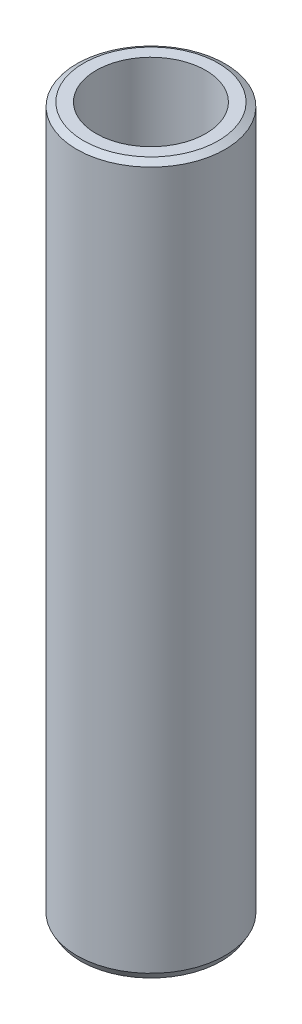
ISO-10303-21;
HEADER;
FILE_DESCRIPTION(('STEP AP214'),'2;1');
FILE_NAME('part.step','',(''),(''),'','','');
FILE_SCHEMA(('AUTOMOTIVE_DESIGN { 1 0 10303 214 1 1 1 1 }'));
ENDSEC;
DATA;
#1=APPLICATION_CONTEXT('core data for automotive mechanical design processes');
#2=APPLICATION_PROTOCOL_DEFINITION('international standard','automotive_design',2000,#1);
#3=PRODUCT_CONTEXT('',#1,'mechanical');
#4=PRODUCT('Part','Part','',(#3));
#5=PRODUCT_RELATED_PRODUCT_CATEGORY('part','',(#4));
#6=PRODUCT_DEFINITION_FORMATION('','',#4);
#7=PRODUCT_DEFINITION_CONTEXT('part definition',#1,'design');
#8=PRODUCT_DEFINITION('design','',#6,#7);
#9=PRODUCT_DEFINITION_SHAPE('','',#8);
#10=(LENGTH_UNIT() NAMED_UNIT(*) SI_UNIT(.MILLI.,.METRE.));
#11=(NAMED_UNIT(*) PLANE_ANGLE_UNIT() SI_UNIT($,.RADIAN.));
#12=(NAMED_UNIT(*) SI_UNIT($,.STERADIAN.) SOLID_ANGLE_UNIT());
#13=UNCERTAINTY_MEASURE_WITH_UNIT(LENGTH_MEASURE(1.E-05),#10,'distance_accuracy_value','');
#14=(GEOMETRIC_REPRESENTATION_CONTEXT(3) GLOBAL_UNCERTAINTY_ASSIGNED_CONTEXT((#13)) GLOBAL_UNIT_ASSIGNED_CONTEXT((#10,
#11,#12)) REPRESENTATION_CONTEXT('',''));
#15=CARTESIAN_POINT('',(0.,0.,0.));
#16=DIRECTION('',(0.,0.,1.));
#17=DIRECTION('',(1.,0.,0.));
#18=AXIS2_PLACEMENT_3D('',#15,#16,#17);
#19=CARTESIAN_POINT('',(0.,477.763012246759,0.));
#20=DIRECTION('',(0.,-1.,0.));
#21=DIRECTION('',(0.,0.,-1.));
#22=AXIS2_PLACEMENT_3D('',#19,#20,#21);
#23=CYLINDRICAL_SURFACE('',#22,50.);
#24=CARTESIAN_POINT('',(0.,475.078419769998,0.));
#25=DIRECTION('',(0.,1.,0.));
#26=DIRECTION('',(0.,0.,1.));
#27=AXIS2_PLACEMENT_3D('',#24,#25,#26);
#28=CIRCLE('',#27,50.);
#29=CARTESIAN_POINT('',(0.,475.078419769998,50.));
#30=VERTEX_POINT('',#29);
#31=EDGE_CURVE('E50',#30,#30,#28,.F.);
#32=ORIENTED_EDGE('',*,*,#31,.T.);
#33=EDGE_LOOP('',(#32));
#34=FACE_BOUND('',#33,.T.);
#35=CARTESIAN_POINT('',(0.,4.649850567368,0.));
#36=DIRECTION('',(0.,1.,0.));
#37=DIRECTION('',(0.,0.,1.));
#38=AXIS2_PLACEMENT_3D('',#35,#36,#37);
#39=CIRCLE('',#38,50.);
#40=CARTESIAN_POINT('',(0.,4.649850567368,50.));
#41=VERTEX_POINT('',#40);
#42=EDGE_CURVE('E51',#41,#41,#39,.T.);
#43=ORIENTED_EDGE('',*,*,#42,.T.);
#44=EDGE_LOOP('',(#43));
#45=FACE_BOUND('',#44,.T.);
#46=ADVANCED_FACE('F39',(#34,#45),#23,.T.);
#47=CARTESIAN_POINT('',(0.,477.763012246759,0.));
#48=DIRECTION('',(0.,1.,0.));
#49=DIRECTION('',(0.,0.,1.));
#50=AXIS2_PLACEMENT_3D('',#47,#48,#49);
#51=PLANE('',#50);
#52=CARTESIAN_POINT('',(0.,477.763012246759,0.));
#53=DIRECTION('',(0.,1.,0.));
#54=DIRECTION('',(0.,0.,1.));
#55=AXIS2_PLACEMENT_3D('',#52,#53,#54);
#56=CIRCLE('',#55,45.3501494326319);
#57=CARTESIAN_POINT('',(0.,477.763012246759,45.3501494326319));
#58=VERTEX_POINT('',#57);
#59=EDGE_CURVE('E54',#58,#58,#56,.T.);
#60=ORIENTED_EDGE('',*,*,#59,.T.);
#61=EDGE_LOOP('',(#60));
#62=FACE_BOUND('',#61,.T.);
#63=CARTESIAN_POINT('',(0.,477.763012246759,0.));
#64=DIRECTION('',(0.,1.,0.));
#65=DIRECTION('',(0.,0.,1.));
#66=AXIS2_PLACEMENT_3D('',#63,#64,#65);
#67=CIRCLE('',#66,36.9398979751974);
#68=CARTESIAN_POINT('',(0.,477.763012246759,36.9398979751974));
#69=VERTEX_POINT('',#68);
#70=EDGE_CURVE('E58',#69,#69,#67,.T.);
#71=ORIENTED_EDGE('',*,*,#70,.F.);
#72=EDGE_LOOP('',(#71));
#73=FACE_BOUND('',#72,.T.);
#74=ADVANCED_FACE('F69',(#62,#73),#51,.T.);
#75=CARTESIAN_POINT('',(0.,0.,0.));
#76=DIRECTION('',(0.,1.,0.));
#77=DIRECTION('',(0.,0.,1.));
#78=AXIS2_PLACEMENT_3D('',#75,#76,#77);
#79=PLANE('',#78);
#80=CARTESIAN_POINT('',(0.,0.,0.));
#81=DIRECTION('',(0.,1.,0.));
#82=DIRECTION('',(0.,0.,1.));
#83=AXIS2_PLACEMENT_3D('',#80,#81,#82);
#84=CIRCLE('',#83,47.3154075232385);
#85=CARTESIAN_POINT('',(0.,0.,47.3154075232385));
#86=VERTEX_POINT('',#85);
#87=EDGE_CURVE('E10',#86,#86,#84,.F.);
#88=ORIENTED_EDGE('',*,*,#87,.T.);
#89=EDGE_LOOP('',(#88));
#90=FACE_BOUND('',#89,.T.);
#91=CARTESIAN_POINT('',(0.,0.,0.));
#92=DIRECTION('',(0.,1.,0.));
#93=DIRECTION('',(0.,0.,1.));
#94=AXIS2_PLACEMENT_3D('',#91,#92,#93);
#95=CIRCLE('',#94,36.9398979751974);
#96=CARTESIAN_POINT('',(0.,0.,36.9398979751974));
#97=VERTEX_POINT('',#96);
#98=EDGE_CURVE('E63',#97,#97,#95,.T.);
#99=ORIENTED_EDGE('',*,*,#98,.T.);
#100=EDGE_LOOP('',(#99));
#101=FACE_BOUND('',#100,.T.);
#102=ADVANCED_FACE('F75',(#90,#101),#79,.F.);
#103=CARTESIAN_POINT('',(0.,477.763012246759,0.));
#104=DIRECTION('',(0.,-1.,0.));
#105=DIRECTION('',(0.,0.,-1.));
#106=AXIS2_PLACEMENT_3D('',#103,#104,#105);
#107=CYLINDRICAL_SURFACE('',#106,36.9398979751974);
#108=ORIENTED_EDGE('',*,*,#70,.T.);
#109=EDGE_LOOP('',(#108));
#110=FACE_BOUND('',#109,.T.);
#111=ORIENTED_EDGE('',*,*,#98,.F.);
#112=EDGE_LOOP('',(#111));
#113=FACE_BOUND('',#112,.T.);
#114=ADVANCED_FACE('F70',(#110,#113),#107,.F.);
#115=CARTESIAN_POINT('',(0.,477.763012246759,0.));
#116=DIRECTION('',(0.,-1.,0.));
#117=DIRECTION('',(0.,0.,-1.));
#118=AXIS2_PLACEMENT_3D('',#115,#116,#117);
#119=CONICAL_SURFACE('',#118,45.3501494326319,1.04719755119659);
#120=ORIENTED_EDGE('',*,*,#31,.F.);
#121=EDGE_LOOP('',(#120));
#122=FACE_BOUND('',#121,.T.);
#123=ORIENTED_EDGE('',*,*,#59,.F.);
#124=EDGE_LOOP('',(#123));
#125=FACE_BOUND('',#124,.T.);
#126=ADVANCED_FACE('F81',(#122,#125),#119,.T.);
#127=CARTESIAN_POINT('',(0.,4.649850567368,0.));
#128=DIRECTION('',(0.,1.,0.));
#129=DIRECTION('',(0.,0.,1.));
#130=AXIS2_PLACEMENT_3D('',#127,#128,#129);
#131=CONICAL_SURFACE('',#130,50.,0.523598775598301);
#132=ORIENTED_EDGE('',*,*,#87,.F.);
#133=EDGE_LOOP('',(#132));
#134=FACE_BOUND('',#133,.T.);
#135=ORIENTED_EDGE('',*,*,#42,.F.);
#136=EDGE_LOOP('',(#135));
#137=FACE_BOUND('',#136,.T.);
#138=ADVANCED_FACE('F45',(#134,#137),#131,.T.);
#139=CLOSED_SHELL('',(#46,#74,#102,#114,#126,#138));
#140=MANIFOLD_SOLID_BREP('B2',#139);
#141=ADVANCED_BREP_SHAPE_REPRESENTATION('',(#18,#140),#14);
#142=SHAPE_DEFINITION_REPRESENTATION(#9,#141);
ENDSEC;
END-ISO-10303-21;
